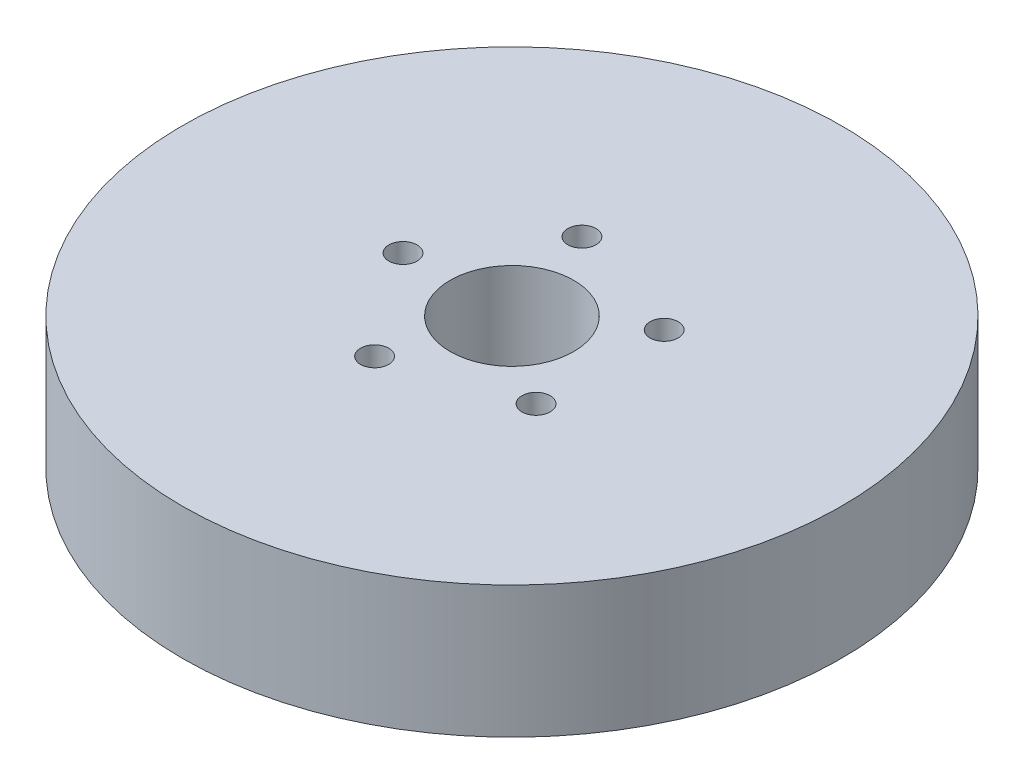
ISO-10303-21;
HEADER;
FILE_DESCRIPTION(('STEP AP214'),'2;1');
FILE_NAME('part.step','',(''),(''),'','','');
FILE_SCHEMA(('AUTOMOTIVE_DESIGN { 1 0 10303 214 1 1 1 1 }'));
ENDSEC;
DATA;
#1=APPLICATION_CONTEXT('core data for automotive mechanical design processes');
#2=APPLICATION_PROTOCOL_DEFINITION('international standard','automotive_design',2000,#1);
#3=PRODUCT_CONTEXT('',#1,'mechanical');
#4=PRODUCT('Part','Part','',(#3));
#5=PRODUCT_RELATED_PRODUCT_CATEGORY('part','',(#4));
#6=PRODUCT_DEFINITION_FORMATION('','',#4);
#7=PRODUCT_DEFINITION_CONTEXT('part definition',#1,'design');
#8=PRODUCT_DEFINITION('design','',#6,#7);
#9=PRODUCT_DEFINITION_SHAPE('','',#8);
#10=(LENGTH_UNIT() NAMED_UNIT(*) SI_UNIT(.MILLI.,.METRE.));
#11=(NAMED_UNIT(*) PLANE_ANGLE_UNIT() SI_UNIT($,.RADIAN.));
#12=(NAMED_UNIT(*) SI_UNIT($,.STERADIAN.) SOLID_ANGLE_UNIT());
#13=UNCERTAINTY_MEASURE_WITH_UNIT(LENGTH_MEASURE(1.E-05),#10,'distance_accuracy_value','');
#14=(GEOMETRIC_REPRESENTATION_CONTEXT(3) GLOBAL_UNCERTAINTY_ASSIGNED_CONTEXT((#13)) GLOBAL_UNIT_ASSIGNED_CONTEXT((#10,
#11,#12)) REPRESENTATION_CONTEXT('',''));
#15=CARTESIAN_POINT('',(0.,0.,0.));
#16=DIRECTION('',(0.,0.,1.));
#17=DIRECTION('',(1.,0.,0.));
#18=AXIS2_PLACEMENT_3D('',#15,#16,#17);
#19=CARTESIAN_POINT('',(0.,16.,0.));
#20=DIRECTION('',(0.,-1.,0.));
#21=DIRECTION('',(0.,0.,-1.));
#22=AXIS2_PLACEMENT_3D('',#19,#20,#21);
#23=CYLINDRICAL_SURFACE('',#22,40.);
#24=CARTESIAN_POINT('',(0.,16.,0.));
#25=DIRECTION('',(0.,1.,0.));
#26=DIRECTION('',(0.,0.,1.));
#27=AXIS2_PLACEMENT_3D('',#24,#25,#26);
#28=CIRCLE('',#27,40.);
#29=CARTESIAN_POINT('',(0.,16.,40.));
#30=VERTEX_POINT('',#29);
#31=EDGE_CURVE('E10',#30,#30,#28,.T.);
#32=ORIENTED_EDGE('',*,*,#31,.F.);
#33=EDGE_LOOP('',(#32));
#34=FACE_BOUND('',#33,.T.);
#35=CARTESIAN_POINT('',(0.,0.,0.));
#36=DIRECTION('',(0.,1.,0.));
#37=DIRECTION('',(0.,0.,1.));
#38=AXIS2_PLACEMENT_3D('',#35,#36,#37);
#39=CIRCLE('',#38,40.);
#40=CARTESIAN_POINT('',(0.,0.,40.));
#41=VERTEX_POINT('',#40);
#42=EDGE_CURVE('E37',#41,#41,#39,.T.);
#43=ORIENTED_EDGE('',*,*,#42,.T.);
#44=EDGE_LOOP('',(#43));
#45=FACE_BOUND('',#44,.T.);
#46=ADVANCED_FACE('F40',(#34,#45),#23,.T.);
#47=CARTESIAN_POINT('',(0.,16.,0.));
#48=DIRECTION('',(0.,1.,0.));
#49=DIRECTION('',(0.,0.,1.));
#50=AXIS2_PLACEMENT_3D('',#47,#48,#49);
#51=PLANE('',#50);
#52=CARTESIAN_POINT('',(-4.08714310454265,16.,12.5789330469304));
#53=DIRECTION('',(0.,1.,0.));
#54=DIRECTION('',(0.951056516295155,0.,0.309016994374945));
#55=AXIS2_PLACEMENT_3D('',#52,#53,#54);
#56=CIRCLE('',#55,1.71092104459894);
#57=CARTESIAN_POINT('',(-2.45996049621032,16.,13.1076367257452));
#58=VERTEX_POINT('',#57);
#59=EDGE_CURVE('E78',#58,#58,#56,.T.);
#60=ORIENTED_EDGE('',*,*,#59,.F.);
#61=EDGE_LOOP('',(#60));
#62=FACE_BOUND('',#61,.T.);
#63=CARTESIAN_POINT('',(10.7002795645775,16.,7.77420816521218));
#64=DIRECTION('',(0.,1.,0.));
#65=DIRECTION('',(0.587785252292469,0.,-0.809016994374951));
#66=AXIS2_PLACEMENT_3D('',#63,#64,#65);
#67=CIRCLE('',#66,1.71092104459894);
#68=CARTESIAN_POINT('',(11.7059337224296,16.,6.3900439640979));
#69=VERTEX_POINT('',#68);
#70=EDGE_CURVE('E71',#69,#69,#67,.T.);
#71=ORIENTED_EDGE('',*,*,#70,.F.);
#72=EDGE_LOOP('',(#71));
#73=FACE_BOUND('',#72,.T.);
#74=CARTESIAN_POINT('',(10.7002795645774,16.,-7.77420816521234));
#75=DIRECTION('',(0.,1.,0.));
#76=DIRECTION('',(-0.58778525229248,0.,-0.809016994374942));
#77=AXIS2_PLACEMENT_3D('',#74,#75,#76);
#78=CIRCLE('',#77,1.71092104459894);
#79=CARTESIAN_POINT('',(9.69462540672534,16.,-9.1583723663266));
#80=VERTEX_POINT('',#79);
#81=EDGE_CURVE('E70',#80,#80,#78,.T.);
#82=ORIENTED_EDGE('',*,*,#81,.F.);
#83=EDGE_LOOP('',(#82));
#84=FACE_BOUND('',#83,.T.);
#85=CARTESIAN_POINT('',(-4.08714310454282,16.,-12.5789330469303));
#86=DIRECTION('',(0.,1.,0.));
#87=DIRECTION('',(-0.95105651629515,0.,0.309016994374958));
#88=AXIS2_PLACEMENT_3D('',#85,#86,#87);
#89=CIRCLE('',#88,1.71092104459894);
#90=CARTESIAN_POINT('',(-5.71432571287515,16.,-12.0502293681155));
#91=VERTEX_POINT('',#90);
#92=EDGE_CURVE('E61',#91,#91,#89,.T.);
#93=ORIENTED_EDGE('',*,*,#92,.F.);
#94=EDGE_LOOP('',(#93));
#95=FACE_BOUND('',#94,.T.);
#96=CARTESIAN_POINT('',(-13.2262729200696,16.,0.));
#97=DIRECTION('',(0.,1.,0.));
#98=DIRECTION('',(0.,0.,1.));
#99=AXIS2_PLACEMENT_3D('',#96,#97,#98);
#100=CIRCLE('',#99,1.71092104459894);
#101=CARTESIAN_POINT('',(-13.2262729200696,16.,1.71092104459894));
#102=VERTEX_POINT('',#101);
#103=EDGE_CURVE('E54',#102,#102,#100,.T.);
#104=ORIENTED_EDGE('',*,*,#103,.F.);
#105=EDGE_LOOP('',(#104));
#106=FACE_BOUND('',#105,.T.);
#107=CARTESIAN_POINT('',(0.,16.,0.));
#108=DIRECTION('',(0.,1.,0.));
#109=DIRECTION('',(0.,0.,1.));
#110=AXIS2_PLACEMENT_3D('',#107,#108,#109);
#111=CIRCLE('',#110,7.5);
#112=CARTESIAN_POINT('',(0.,16.,7.5));
#113=VERTEX_POINT('',#112);
#114=EDGE_CURVE('E50',#113,#113,#111,.T.);
#115=ORIENTED_EDGE('',*,*,#114,.F.);
#116=EDGE_LOOP('',(#115));
#117=FACE_BOUND('',#116,.T.);
#118=ORIENTED_EDGE('',*,*,#31,.T.);
#119=EDGE_LOOP('',(#118));
#120=FACE_BOUND('',#119,.T.);
#121=ADVANCED_FACE('F94',(#62,#73,#84,#95,#106,#117,#120),#51,.T.);
#122=CARTESIAN_POINT('',(0.,0.,0.));
#123=DIRECTION('',(0.,1.,0.));
#124=DIRECTION('',(0.,0.,1.));
#125=AXIS2_PLACEMENT_3D('',#122,#123,#124);
#126=PLANE('',#125);
#127=CARTESIAN_POINT('',(0.,0.,0.));
#128=DIRECTION('',(0.,1.,0.));
#129=DIRECTION('',(0.,0.,1.));
#130=AXIS2_PLACEMENT_3D('',#127,#128,#129);
#131=CIRCLE('',#130,7.5);
#132=CARTESIAN_POINT('',(0.,0.,7.5));
#133=VERTEX_POINT('',#132);
#134=EDGE_CURVE('E47',#133,#133,#131,.T.);
#135=ORIENTED_EDGE('',*,*,#134,.T.);
#136=EDGE_LOOP('',(#135));
#137=FACE_BOUND('',#136,.T.);
#138=ORIENTED_EDGE('',*,*,#42,.F.);
#139=EDGE_LOOP('',(#138));
#140=FACE_BOUND('',#139,.T.);
#141=ADVANCED_FACE('F100',(#137,#140),#126,.F.);
#142=CARTESIAN_POINT('',(0.,16.,0.));
#143=DIRECTION('',(0.,-1.,0.));
#144=DIRECTION('',(0.,0.,-1.));
#145=AXIS2_PLACEMENT_3D('',#142,#143,#144);
#146=CYLINDRICAL_SURFACE('',#145,7.5);
#147=ORIENTED_EDGE('',*,*,#114,.T.);
#148=EDGE_LOOP('',(#147));
#149=FACE_BOUND('',#148,.T.);
#150=ORIENTED_EDGE('',*,*,#134,.F.);
#151=EDGE_LOOP('',(#150));
#152=FACE_BOUND('',#151,.T.);
#153=ADVANCED_FACE('F108',(#149,#152),#146,.F.);
#154=CARTESIAN_POINT('',(-13.2262729200696,5.18489982195032,0.));
#155=DIRECTION('',(0.,1.,0.));
#156=DIRECTION('',(0.,0.,1.));
#157=AXIS2_PLACEMENT_3D('',#154,#155,#156);
#158=CYLINDRICAL_SURFACE('',#157,1.71092104459894);
#159=CARTESIAN_POINT('',(-13.2262729200696,5.18489982195032,0.));
#160=DIRECTION('',(0.,1.,0.));
#161=DIRECTION('',(0.,0.,1.));
#162=AXIS2_PLACEMENT_3D('',#159,#160,#161);
#163=CIRCLE('',#162,1.71092104459894);
#164=CARTESIAN_POINT('',(-13.2262729200696,5.18489982195032,1.71092104459894));
#165=VERTEX_POINT('',#164);
#166=EDGE_CURVE('E55',#165,#165,#163,.T.);
#167=ORIENTED_EDGE('',*,*,#166,.F.);
#168=EDGE_LOOP('',(#167));
#169=FACE_BOUND('',#168,.T.);
#170=ORIENTED_EDGE('',*,*,#103,.T.);
#171=EDGE_LOOP('',(#170));
#172=FACE_BOUND('',#171,.T.);
#173=ADVANCED_FACE('F115',(#169,#172),#158,.F.);
#174=CARTESIAN_POINT('',(-13.2262729200696,5.18489982195032,0.));
#175=DIRECTION('',(0.,1.,0.));
#176=DIRECTION('',(0.,0.,1.));
#177=AXIS2_PLACEMENT_3D('',#174,#175,#176);
#178=PLANE('',#177);
#179=ORIENTED_EDGE('',*,*,#166,.T.);
#180=EDGE_LOOP('',(#179));
#181=FACE_BOUND('',#180,.T.);
#182=ADVANCED_FACE('F142',(#181),#178,.T.);
#183=CARTESIAN_POINT('',(-4.08714310454282,5.18489982195032,-12.5789330469303));
#184=DIRECTION('',(0.,1.,0.));
#185=DIRECTION('',(0.,0.,1.));
#186=AXIS2_PLACEMENT_3D('',#183,#184,#185);
#187=CYLINDRICAL_SURFACE('',#186,1.71092104459894);
#188=CARTESIAN_POINT('',(-4.08714310454282,5.18489982195032,-12.5789330469303));
#189=DIRECTION('',(0.,1.,0.));
#190=DIRECTION('',(-0.95105651629515,0.,0.309016994374958));
#191=AXIS2_PLACEMENT_3D('',#188,#189,#190);
#192=CIRCLE('',#191,1.71092104459894);
#193=CARTESIAN_POINT('',(-5.71432571287515,5.18489982195032,-12.0502293681155));
#194=VERTEX_POINT('',#193);
#195=EDGE_CURVE('E63',#194,#194,#192,.T.);
#196=ORIENTED_EDGE('',*,*,#195,.F.);
#197=EDGE_LOOP('',(#196));
#198=FACE_BOUND('',#197,.T.);
#199=ORIENTED_EDGE('',*,*,#92,.T.);
#200=EDGE_LOOP('',(#199));
#201=FACE_BOUND('',#200,.T.);
#202=ADVANCED_FACE('F147',(#198,#201),#187,.F.);
#203=CARTESIAN_POINT('',(-4.08714310454282,5.18489982195032,-12.5789330469303));
#204=DIRECTION('',(0.,1.,0.));
#205=DIRECTION('',(-0.95105651629515,0.,0.309016994374958));
#206=AXIS2_PLACEMENT_3D('',#203,#204,#205);
#207=PLANE('',#206);
#208=ORIENTED_EDGE('',*,*,#195,.T.);
#209=EDGE_LOOP('',(#208));
#210=FACE_BOUND('',#209,.T.);
#211=ADVANCED_FACE('F163',(#210),#207,.T.);
#212=CARTESIAN_POINT('',(10.7002795645774,5.18489982195032,-7.77420816521234));
#213=DIRECTION('',(0.,1.,0.));
#214=DIRECTION('',(0.,0.,1.));
#215=AXIS2_PLACEMENT_3D('',#212,#213,#214);
#216=CYLINDRICAL_SURFACE('',#215,1.71092104459894);
#217=CARTESIAN_POINT('',(10.7002795645774,5.18489982195032,-7.77420816521234));
#218=DIRECTION('',(0.,1.,0.));
#219=DIRECTION('',(-0.58778525229248,0.,-0.809016994374942));
#220=AXIS2_PLACEMENT_3D('',#217,#218,#219);
#221=CIRCLE('',#220,1.71092104459894);
#222=CARTESIAN_POINT('',(9.69462540672534,5.18489982195032,-9.1583723663266));
#223=VERTEX_POINT('',#222);
#224=EDGE_CURVE('E69',#223,#223,#221,.T.);
#225=ORIENTED_EDGE('',*,*,#224,.F.);
#226=EDGE_LOOP('',(#225));
#227=FACE_BOUND('',#226,.T.);
#228=ORIENTED_EDGE('',*,*,#81,.T.);
#229=EDGE_LOOP('',(#228));
#230=FACE_BOUND('',#229,.T.);
#231=ADVANCED_FACE('F172',(#227,#230),#216,.F.);
#232=CARTESIAN_POINT('',(10.7002795645774,5.18489982195032,-7.77420816521234));
#233=DIRECTION('',(0.,1.,0.));
#234=DIRECTION('',(-0.58778525229248,0.,-0.809016994374942));
#235=AXIS2_PLACEMENT_3D('',#232,#233,#234);
#236=PLANE('',#235);
#237=ORIENTED_EDGE('',*,*,#224,.T.);
#238=EDGE_LOOP('',(#237));
#239=FACE_BOUND('',#238,.T.);
#240=ADVANCED_FACE('F185',(#239),#236,.T.);
#241=CARTESIAN_POINT('',(10.7002795645775,5.18489982195032,7.77420816521218));
#242=DIRECTION('',(0.,1.,0.));
#243=DIRECTION('',(0.,0.,1.));
#244=AXIS2_PLACEMENT_3D('',#241,#242,#243);
#245=CYLINDRICAL_SURFACE('',#244,1.71092104459894);
#246=CARTESIAN_POINT('',(10.7002795645775,5.18489982195032,7.77420816521218));
#247=DIRECTION('',(0.,1.,0.));
#248=DIRECTION('',(0.587785252292469,0.,-0.809016994374951));
#249=AXIS2_PLACEMENT_3D('',#246,#247,#248);
#250=CIRCLE('',#249,1.71092104459894);
#251=CARTESIAN_POINT('',(11.7059337224296,5.18489982195032,6.3900439640979));
#252=VERTEX_POINT('',#251);
#253=EDGE_CURVE('E76',#252,#252,#250,.T.);
#254=ORIENTED_EDGE('',*,*,#253,.F.);
#255=EDGE_LOOP('',(#254));
#256=FACE_BOUND('',#255,.T.);
#257=ORIENTED_EDGE('',*,*,#70,.T.);
#258=EDGE_LOOP('',(#257));
#259=FACE_BOUND('',#258,.T.);
#260=ADVANCED_FACE('F191',(#256,#259),#245,.F.);
#261=CARTESIAN_POINT('',(10.7002795645775,5.18489982195032,7.77420816521218));
#262=DIRECTION('',(0.,1.,0.));
#263=DIRECTION('',(0.587785252292469,0.,-0.809016994374951));
#264=AXIS2_PLACEMENT_3D('',#261,#262,#263);
#265=PLANE('',#264);
#266=ORIENTED_EDGE('',*,*,#253,.T.);
#267=EDGE_LOOP('',(#266));
#268=FACE_BOUND('',#267,.T.);
#269=ADVANCED_FACE('F89',(#268),#265,.T.);
#270=CARTESIAN_POINT('',(-4.08714310454265,5.18489982195032,12.5789330469304));
#271=DIRECTION('',(0.,1.,0.));
#272=DIRECTION('',(0.,0.,1.));
#273=AXIS2_PLACEMENT_3D('',#270,#271,#272);
#274=CYLINDRICAL_SURFACE('',#273,1.71092104459894);
#275=CARTESIAN_POINT('',(-4.08714310454265,5.18489982195032,12.5789330469304));
#276=DIRECTION('',(0.,1.,0.));
#277=DIRECTION('',(0.951056516295155,0.,0.309016994374945));
#278=AXIS2_PLACEMENT_3D('',#275,#276,#277);
#279=CIRCLE('',#278,1.71092104459894);
#280=CARTESIAN_POINT('',(-2.45996049621032,5.18489982195032,13.1076367257452));
#281=VERTEX_POINT('',#280);
#282=EDGE_CURVE('E59',#281,#281,#279,.T.);
#283=ORIENTED_EDGE('',*,*,#282,.F.);
#284=EDGE_LOOP('',(#283));
#285=FACE_BOUND('',#284,.T.);
#286=ORIENTED_EDGE('',*,*,#59,.T.);
#287=EDGE_LOOP('',(#286));
#288=FACE_BOUND('',#287,.T.);
#289=ADVANCED_FACE('F87',(#285,#288),#274,.F.);
#290=CARTESIAN_POINT('',(-4.08714310454265,5.18489982195032,12.5789330469304));
#291=DIRECTION('',(0.,1.,0.));
#292=DIRECTION('',(0.951056516295155,0.,0.309016994374945));
#293=AXIS2_PLACEMENT_3D('',#290,#291,#292);
#294=PLANE('',#293);
#295=ORIENTED_EDGE('',*,*,#282,.T.);
#296=EDGE_LOOP('',(#295));
#297=FACE_BOUND('',#296,.T.);
#298=ADVANCED_FACE('F84',(#297),#294,.T.);
#299=CLOSED_SHELL('',(#46,#121,#141,#153,#173,#182,#202,#211,#231,#240,#260,#269,#289,#298));
#300=MANIFOLD_SOLID_BREP('B2',#299);
#301=ADVANCED_BREP_SHAPE_REPRESENTATION('',(#18,#300),#14);
#302=SHAPE_DEFINITION_REPRESENTATION(#9,#301);
ENDSEC;
END-ISO-10303-21;
